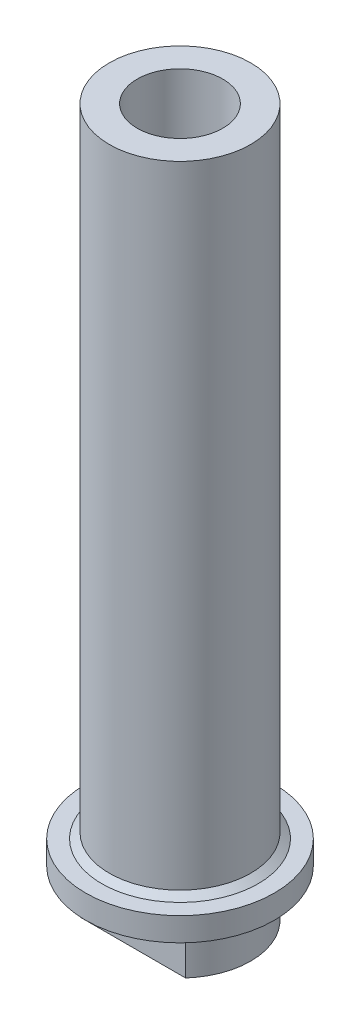
ISO-10303-21;
HEADER;
FILE_DESCRIPTION(('STEP AP214'),'2;1');
FILE_NAME('part.step','',(''),(''),'','','');
FILE_SCHEMA(('AUTOMOTIVE_DESIGN { 1 0 10303 214 1 1 1 1 }'));
ENDSEC;
DATA;
#1=APPLICATION_CONTEXT('core data for automotive mechanical design processes');
#2=APPLICATION_PROTOCOL_DEFINITION('international standard','automotive_design',2000,#1);
#3=PRODUCT_CONTEXT('',#1,'mechanical');
#4=PRODUCT('Part','Part','',(#3));
#5=PRODUCT_RELATED_PRODUCT_CATEGORY('part','',(#4));
#6=PRODUCT_DEFINITION_FORMATION('','',#4);
#7=PRODUCT_DEFINITION_CONTEXT('part definition',#1,'design');
#8=PRODUCT_DEFINITION('design','',#6,#7);
#9=PRODUCT_DEFINITION_SHAPE('','',#8);
#10=(LENGTH_UNIT() NAMED_UNIT(*) SI_UNIT(.MILLI.,.METRE.));
#11=(NAMED_UNIT(*) PLANE_ANGLE_UNIT() SI_UNIT($,.RADIAN.));
#12=(NAMED_UNIT(*) SI_UNIT($,.STERADIAN.) SOLID_ANGLE_UNIT());
#13=UNCERTAINTY_MEASURE_WITH_UNIT(LENGTH_MEASURE(1.E-05),#10,'distance_accuracy_value','');
#14=(GEOMETRIC_REPRESENTATION_CONTEXT(3) GLOBAL_UNCERTAINTY_ASSIGNED_CONTEXT((#13)) GLOBAL_UNIT_ASSIGNED_CONTEXT((#10,
#11,#12)) REPRESENTATION_CONTEXT('',''));
#15=CARTESIAN_POINT('',(0.,0.,0.));
#16=DIRECTION('',(0.,0.,1.));
#17=DIRECTION('',(1.,0.,0.));
#18=AXIS2_PLACEMENT_3D('',#15,#16,#17);
#19=CARTESIAN_POINT('',(0.,95.25,0.));
#20=DIRECTION('',(0.,-1.,0.));
#21=DIRECTION('',(0.,0.,-1.));
#22=AXIS2_PLACEMENT_3D('',#19,#20,#21);
#23=CYLINDRICAL_SURFACE('',#22,9.525);
#24=CARTESIAN_POINT('',(0.,6.35,0.));
#25=DIRECTION('',(0.,-1.,0.));
#26=DIRECTION('',(0.,0.,-1.));
#27=AXIS2_PLACEMENT_3D('',#24,#25,#26);
#28=CIRCLE('',#27,9.525);
#29=CARTESIAN_POINT('',(-7.09951582856183,6.35,6.35));
#30=VERTEX_POINT('',#29);
#31=CARTESIAN_POINT('',(-7.09951582856183,6.35,-6.35));
#32=VERTEX_POINT('',#31);
#33=EDGE_CURVE('E106',#30,#32,#28,.T.);
#34=ORIENTED_EDGE('',*,*,#33,.T.);
#35=DIRECTION('',(0.,-1.,0.));
#36=VECTOR('',#35,1.);
#37=CARTESIAN_POINT('',(-7.09951582856183,95.25,-6.35));
#38=LINE('',#37,#36);
#39=CARTESIAN_POINT('',(-7.09951582856183,0.,-6.35));
#40=VERTEX_POINT('',#39);
#41=EDGE_CURVE('E202',#32,#40,#38,.T.);
#42=ORIENTED_EDGE('',*,*,#41,.T.);
#43=CARTESIAN_POINT('',(0.,0.,0.));
#44=DIRECTION('',(0.,1.,0.));
#45=DIRECTION('',(0.,0.,1.));
#46=AXIS2_PLACEMENT_3D('',#43,#44,#45);
#47=CIRCLE('',#46,9.525);
#48=CARTESIAN_POINT('',(-7.09951582856183,0.,6.35));
#49=VERTEX_POINT('',#48);
#50=EDGE_CURVE('E108',#40,#49,#47,.T.);
#51=ORIENTED_EDGE('',*,*,#50,.T.);
#52=DIRECTION('',(0.,-1.,0.));
#53=VECTOR('',#52,1.);
#54=CARTESIAN_POINT('',(-7.09951582856183,95.25,6.35));
#55=LINE('',#54,#53);
#56=EDGE_CURVE('E93',#49,#30,#55,.F.);
#57=ORIENTED_EDGE('',*,*,#56,.T.);
#58=EDGE_LOOP('',(#34,#42,#51,#57));
#59=FACE_BOUND('',#58,.T.);
#60=ADVANCED_FACE('F47',(#59),#23,.T.);
#61=CARTESIAN_POINT('',(0.,95.25,0.));
#62=DIRECTION('',(0.,-1.,0.));
#63=DIRECTION('',(0.,0.,-1.));
#64=AXIS2_PLACEMENT_3D('',#61,#62,#63);
#65=CYLINDRICAL_SURFACE('',#64,3.175);
#66=CARTESIAN_POINT('',(0.,0.,0.));
#67=DIRECTION('',(0.,1.,0.));
#68=DIRECTION('',(0.,0.,1.));
#69=AXIS2_PLACEMENT_3D('',#66,#67,#68);
#70=CIRCLE('',#69,3.175);
#71=CARTESIAN_POINT('',(0.,0.,3.175));
#72=VERTEX_POINT('',#71);
#73=EDGE_CURVE('E128',#72,#72,#70,.T.);
#74=ORIENTED_EDGE('',*,*,#73,.F.);
#75=EDGE_LOOP('',(#74));
#76=FACE_BOUND('',#75,.T.);
#77=CARTESIAN_POINT('',(0.,76.2,0.));
#78=DIRECTION('',(0.,1.,0.));
#79=DIRECTION('',(0.,0.,1.));
#80=AXIS2_PLACEMENT_3D('',#77,#78,#79);
#81=CIRCLE('',#80,3.175);
#82=CARTESIAN_POINT('',(0.,76.2,3.175));
#83=VERTEX_POINT('',#82);
#84=EDGE_CURVE('E114',#83,#83,#81,.T.);
#85=ORIENTED_EDGE('',*,*,#84,.T.);
#86=EDGE_LOOP('',(#85));
#87=FACE_BOUND('',#86,.T.);
#88=ADVANCED_FACE('F164',(#76,#87),#65,.F.);
#89=CARTESIAN_POINT('',(0.,10.2515425280054,0.));
#90=DIRECTION('',(0.,-1.,0.));
#91=DIRECTION('',(0.,0.,-1.));
#92=AXIS2_PLACEMENT_3D('',#89,#90,#91);
#93=CIRCLE('',#92,9.525);
#94=CARTESIAN_POINT('',(0.,10.2515425280054,-9.525));
#95=VERTEX_POINT('',#94);
#96=EDGE_CURVE('E11',#95,#95,#93,.F.);
#97=ORIENTED_EDGE('',*,*,#96,.T.);
#98=EDGE_LOOP('',(#97));
#99=FACE_BOUND('',#98,.T.);
#100=CARTESIAN_POINT('',(0.,95.25,0.));
#101=DIRECTION('',(0.,1.,0.));
#102=DIRECTION('',(0.,0.,1.));
#103=AXIS2_PLACEMENT_3D('',#100,#101,#102);
#104=CIRCLE('',#103,9.525);
#105=CARTESIAN_POINT('',(0.,95.25,9.525));
#106=VERTEX_POINT('',#105);
#107=EDGE_CURVE('E135',#106,#106,#104,.T.);
#108=ORIENTED_EDGE('',*,*,#107,.F.);
#109=EDGE_LOOP('',(#108));
#110=FACE_BOUND('',#109,.T.);
#111=ADVANCED_FACE('F165',(#99,#110),#23,.T.);
#112=CARTESIAN_POINT('',(0.,95.25,0.));
#113=DIRECTION('',(0.,1.,0.));
#114=DIRECTION('',(0.,0.,1.));
#115=AXIS2_PLACEMENT_3D('',#112,#113,#114);
#116=PLANE('',#115);
#117=CARTESIAN_POINT('',(0.,95.25,0.));
#118=DIRECTION('',(0.,1.,0.));
#119=DIRECTION('',(0.,0.,1.));
#120=AXIS2_PLACEMENT_3D('',#117,#118,#119);
#121=CIRCLE('',#120,5.75437);
#122=CARTESIAN_POINT('',(0.,95.25,5.75437));
#123=VERTEX_POINT('',#122);
#124=EDGE_CURVE('E204',#123,#123,#121,.T.);
#125=ORIENTED_EDGE('',*,*,#124,.F.);
#126=EDGE_LOOP('',(#125));
#127=FACE_BOUND('',#126,.T.);
#128=ORIENTED_EDGE('',*,*,#107,.T.);
#129=EDGE_LOOP('',(#128));
#130=FACE_BOUND('',#129,.T.);
#131=ADVANCED_FACE('F174',(#127,#130),#116,.T.);
#132=CARTESIAN_POINT('',(0.,0.,0.));
#133=DIRECTION('',(0.,1.,0.));
#134=DIRECTION('',(0.,0.,1.));
#135=AXIS2_PLACEMENT_3D('',#132,#133,#134);
#136=PLANE('',#135);
#137=ORIENTED_EDGE('',*,*,#50,.F.);
#138=DIRECTION('',(-1.,0.,0.));
#139=VECTOR('',#138,1.);
#140=CARTESIAN_POINT('',(-7.62,0.,-6.35));
#141=LINE('',#140,#139);
#142=CARTESIAN_POINT('',(7.09951582856183,0.,-6.35));
#143=VERTEX_POINT('',#142);
#144=EDGE_CURVE('E99',#143,#40,#141,.T.);
#145=ORIENTED_EDGE('',*,*,#144,.F.);
#146=CARTESIAN_POINT('',(7.09951582856183,0.,6.35));
#147=VERTEX_POINT('',#146);
#148=EDGE_CURVE('E139',#147,#143,#47,.T.);
#149=ORIENTED_EDGE('',*,*,#148,.F.);
#150=DIRECTION('',(1.,0.,0.));
#151=VECTOR('',#150,1.);
#152=CARTESIAN_POINT('',(-7.62,0.,6.35));
#153=LINE('',#152,#151);
#154=EDGE_CURVE('E100',#49,#147,#153,.T.);
#155=ORIENTED_EDGE('',*,*,#154,.F.);
#156=EDGE_LOOP('',(#137,#145,#149,#155));
#157=FACE_BOUND('',#156,.T.);
#158=ORIENTED_EDGE('',*,*,#73,.T.);
#159=EDGE_LOOP('',(#158));
#160=FACE_BOUND('',#159,.T.);
#161=ADVANCED_FACE('F178',(#157,#160),#136,.F.);
#162=ORIENTED_EDGE('',*,*,#148,.T.);
#163=DIRECTION('',(0.,-1.,0.));
#164=VECTOR('',#163,1.);
#165=CARTESIAN_POINT('',(7.09951582856183,95.25,-6.35));
#166=LINE('',#165,#164);
#167=CARTESIAN_POINT('',(7.09951582856183,6.35,-6.35));
#168=VERTEX_POINT('',#167);
#169=EDGE_CURVE('E189',#143,#168,#166,.F.);
#170=ORIENTED_EDGE('',*,*,#169,.T.);
#171=CARTESIAN_POINT('',(7.09951582856183,6.35,6.35));
#172=VERTEX_POINT('',#171);
#173=EDGE_CURVE('E113',#168,#172,#28,.T.);
#174=ORIENTED_EDGE('',*,*,#173,.T.);
#175=DIRECTION('',(0.,-1.,0.));
#176=VECTOR('',#175,1.);
#177=CARTESIAN_POINT('',(7.09951582856183,95.25,6.35));
#178=LINE('',#177,#176);
#179=EDGE_CURVE('E96',#172,#147,#178,.T.);
#180=ORIENTED_EDGE('',*,*,#179,.T.);
#181=EDGE_LOOP('',(#162,#170,#174,#180));
#182=FACE_BOUND('',#181,.T.);
#183=ADVANCED_FACE('F166',(#182),#23,.T.);
#184=CARTESIAN_POINT('',(0.,9.525,0.));
#185=DIRECTION('',(0.,-1.,0.));
#186=DIRECTION('',(0.,0.,-1.));
#187=AXIS2_PLACEMENT_3D('',#184,#185,#186);
#188=CYLINDRICAL_SURFACE('',#187,12.7);
#189=CARTESIAN_POINT('',(0.,9.525,0.));
#190=DIRECTION('',(0.,-1.,0.));
#191=DIRECTION('',(0.,0.,-1.));
#192=AXIS2_PLACEMENT_3D('',#189,#190,#191);
#193=CIRCLE('',#192,12.7);
#194=CARTESIAN_POINT('',(0.,9.525,-12.7));
#195=VERTEX_POINT('',#194);
#196=EDGE_CURVE('E124',#195,#195,#193,.T.);
#197=ORIENTED_EDGE('',*,*,#196,.T.);
#198=EDGE_LOOP('',(#197));
#199=FACE_BOUND('',#198,.T.);
#200=CARTESIAN_POINT('',(0.,6.35,0.));
#201=DIRECTION('',(0.,-1.,0.));
#202=DIRECTION('',(0.,0.,-1.));
#203=AXIS2_PLACEMENT_3D('',#200,#201,#202);
#204=CIRCLE('',#203,12.7);
#205=CARTESIAN_POINT('',(0.,6.35,-12.7));
#206=VERTEX_POINT('',#205);
#207=EDGE_CURVE('E117',#206,#206,#204,.T.);
#208=ORIENTED_EDGE('',*,*,#207,.F.);
#209=EDGE_LOOP('',(#208));
#210=FACE_BOUND('',#209,.T.);
#211=ADVANCED_FACE('F177',(#199,#210),#188,.T.);
#212=CARTESIAN_POINT('',(0.,9.525,0.));
#213=DIRECTION('',(0.,-1.,0.));
#214=DIRECTION('',(0.,0.,-1.));
#215=AXIS2_PLACEMENT_3D('',#212,#213,#214);
#216=PLANE('',#215);
#217=CARTESIAN_POINT('',(0.,9.525,0.));
#218=DIRECTION('',(0.,-1.,0.));
#219=DIRECTION('',(0.,0.,-1.));
#220=AXIS2_PLACEMENT_3D('',#217,#218,#219);
#221=CIRCLE('',#220,10.525);
#222=CARTESIAN_POINT('',(0.,9.525,-10.525));
#223=VERTEX_POINT('',#222);
#224=EDGE_CURVE('E56',#223,#223,#221,.T.);
#225=ORIENTED_EDGE('',*,*,#224,.T.);
#226=EDGE_LOOP('',(#225));
#227=FACE_BOUND('',#226,.T.);
#228=ORIENTED_EDGE('',*,*,#196,.F.);
#229=EDGE_LOOP('',(#228));
#230=FACE_BOUND('',#229,.T.);
#231=ADVANCED_FACE('F147',(#227,#230),#216,.F.);
#232=CARTESIAN_POINT('',(0.,6.35,0.));
#233=DIRECTION('',(0.,-1.,0.));
#234=DIRECTION('',(0.,0.,-1.));
#235=AXIS2_PLACEMENT_3D('',#232,#233,#234);
#236=PLANE('',#235);
#237=ORIENTED_EDGE('',*,*,#207,.T.);
#238=EDGE_LOOP('',(#237));
#239=FACE_BOUND('',#238,.T.);
#240=ORIENTED_EDGE('',*,*,#173,.F.);
#241=DIRECTION('',(1.,0.,0.));
#242=VECTOR('',#241,1.);
#243=CARTESIAN_POINT('',(-7.62,6.35,-6.35));
#244=LINE('',#243,#242);
#245=EDGE_CURVE('E66',#32,#168,#244,.T.);
#246=ORIENTED_EDGE('',*,*,#245,.F.);
#247=ORIENTED_EDGE('',*,*,#33,.F.);
#248=DIRECTION('',(-1.,0.,0.));
#249=VECTOR('',#248,1.);
#250=CARTESIAN_POINT('',(-7.62,6.35,6.35));
#251=LINE('',#250,#249);
#252=EDGE_CURVE('E73',#172,#30,#251,.T.);
#253=ORIENTED_EDGE('',*,*,#252,.F.);
#254=EDGE_LOOP('',(#240,#246,#247,#253));
#255=FACE_BOUND('',#254,.T.);
#256=ADVANCED_FACE('F111',(#239,#255),#236,.T.);
#257=CARTESIAN_POINT('',(0.,95.25,0.));
#258=DIRECTION('',(0.,1.,0.));
#259=DIRECTION('',(0.,0.,1.));
#260=AXIS2_PLACEMENT_3D('',#257,#258,#259);
#261=CYLINDRICAL_SURFACE('',#260,5.75437);
#262=CARTESIAN_POINT('',(0.,76.2,0.));
#263=DIRECTION('',(0.,1.,0.));
#264=DIRECTION('',(0.,0.,1.));
#265=AXIS2_PLACEMENT_3D('',#262,#263,#264);
#266=CIRCLE('',#265,5.75437);
#267=CARTESIAN_POINT('',(0.,76.2,5.75437));
#268=VERTEX_POINT('',#267);
#269=EDGE_CURVE('E120',#268,#268,#266,.F.);
#270=ORIENTED_EDGE('',*,*,#269,.T.);
#271=EDGE_LOOP('',(#270));
#272=FACE_BOUND('',#271,.T.);
#273=ORIENTED_EDGE('',*,*,#124,.T.);
#274=EDGE_LOOP('',(#273));
#275=FACE_BOUND('',#274,.T.);
#276=ADVANCED_FACE('F159',(#272,#275),#261,.F.);
#277=CARTESIAN_POINT('',(0.,76.2,0.));
#278=DIRECTION('',(0.,1.,0.));
#279=DIRECTION('',(0.,0.,1.));
#280=AXIS2_PLACEMENT_3D('',#277,#278,#279);
#281=PLANE('',#280);
#282=ORIENTED_EDGE('',*,*,#84,.F.);
#283=EDGE_LOOP('',(#282));
#284=FACE_BOUND('',#283,.T.);
#285=ORIENTED_EDGE('',*,*,#269,.F.);
#286=EDGE_LOOP('',(#285));
#287=FACE_BOUND('',#286,.T.);
#288=ADVANCED_FACE('F151',(#284,#287),#281,.T.);
#289=CARTESIAN_POINT('',(0.,9.52500000000001,0.));
#290=DIRECTION('',(0.,-1.,0.));
#291=DIRECTION('',(0.,0.,-1.));
#292=AXIS2_PLACEMENT_3D('',#289,#290,#291);
#293=CONICAL_SURFACE('',#292,10.525,0.942477796076936);
#294=ORIENTED_EDGE('',*,*,#96,.F.);
#295=EDGE_LOOP('',(#294));
#296=FACE_BOUND('',#295,.T.);
#297=ORIENTED_EDGE('',*,*,#224,.F.);
#298=EDGE_LOOP('',(#297));
#299=FACE_BOUND('',#298,.T.);
#300=ADVANCED_FACE('F49',(#296,#299),#293,.T.);
#301=CARTESIAN_POINT('',(-7.62,24.6417536561942,6.35));
#302=DIRECTION('',(0.,0.,-1.));
#303=DIRECTION('',(-1.,0.,0.));
#304=AXIS2_PLACEMENT_3D('',#301,#302,#303);
#305=PLANE('',#304);
#306=ORIENTED_EDGE('',*,*,#252,.T.);
#307=ORIENTED_EDGE('',*,*,#56,.F.);
#308=ORIENTED_EDGE('',*,*,#154,.T.);
#309=ORIENTED_EDGE('',*,*,#179,.F.);
#310=EDGE_LOOP('',(#306,#307,#308,#309));
#311=FACE_BOUND('',#310,.T.);
#312=ADVANCED_FACE('F92',(#311),#305,.F.);
#313=CARTESIAN_POINT('',(-7.62,24.6417536561942,-6.35));
#314=DIRECTION('',(0.,0.,1.));
#315=DIRECTION('',(1.,0.,0.));
#316=AXIS2_PLACEMENT_3D('',#313,#314,#315);
#317=PLANE('',#316);
#318=ORIENTED_EDGE('',*,*,#245,.T.);
#319=ORIENTED_EDGE('',*,*,#169,.F.);
#320=ORIENTED_EDGE('',*,*,#144,.T.);
#321=ORIENTED_EDGE('',*,*,#41,.F.);
#322=EDGE_LOOP('',(#318,#319,#320,#321));
#323=FACE_BOUND('',#322,.T.);
#324=ADVANCED_FACE('F157',(#323),#317,.F.);
#325=CLOSED_SHELL('',(#60,#88,#111,#131,#161,#183,#211,#231,#256,#276,#288,#300,#312,#324));
#326=MANIFOLD_SOLID_BREP('B2',#325);
#327=ADVANCED_BREP_SHAPE_REPRESENTATION('',(#18,#326),#14);
#328=SHAPE_DEFINITION_REPRESENTATION(#9,#327);
ENDSEC;
END-ISO-10303-21;
